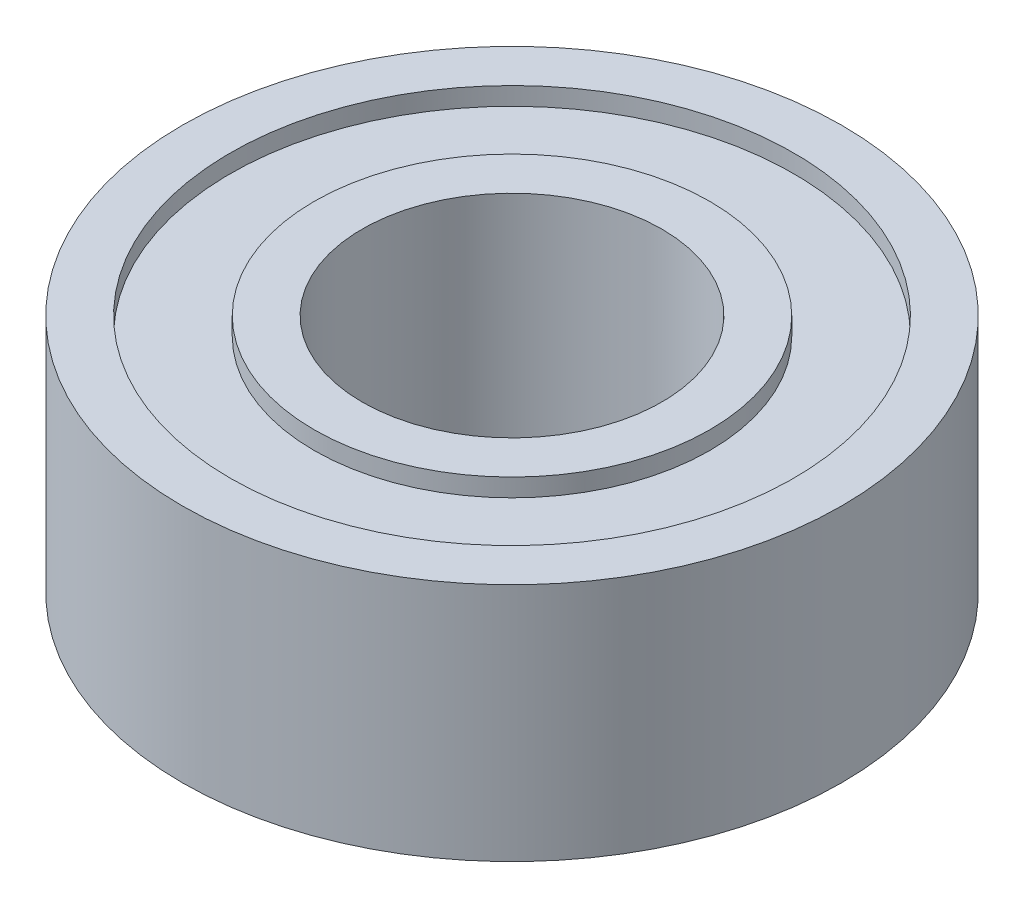
ISO-10303-21;
HEADER;
FILE_DESCRIPTION(('STEP AP214'),'2;1');
FILE_NAME('part.step','',(''),(''),'','','');
FILE_SCHEMA(('AUTOMOTIVE_DESIGN { 1 0 10303 214 1 1 1 1 }'));
ENDSEC;
DATA;
#1=APPLICATION_CONTEXT('core data for automotive mechanical design processes');
#2=APPLICATION_PROTOCOL_DEFINITION('international standard','automotive_design',2000,#1);
#3=PRODUCT_CONTEXT('',#1,'mechanical');
#4=PRODUCT('Part','Part','',(#3));
#5=PRODUCT_RELATED_PRODUCT_CATEGORY('part','',(#4));
#6=PRODUCT_DEFINITION_FORMATION('','',#4);
#7=PRODUCT_DEFINITION_CONTEXT('part definition',#1,'design');
#8=PRODUCT_DEFINITION('design','',#6,#7);
#9=PRODUCT_DEFINITION_SHAPE('','',#8);
#10=(LENGTH_UNIT() NAMED_UNIT(*) SI_UNIT(.MILLI.,.METRE.));
#11=(NAMED_UNIT(*) PLANE_ANGLE_UNIT() SI_UNIT($,.RADIAN.));
#12=(NAMED_UNIT(*) SI_UNIT($,.STERADIAN.) SOLID_ANGLE_UNIT());
#13=UNCERTAINTY_MEASURE_WITH_UNIT(LENGTH_MEASURE(1.E-05),#10,'distance_accuracy_value','');
#14=(GEOMETRIC_REPRESENTATION_CONTEXT(3) GLOBAL_UNCERTAINTY_ASSIGNED_CONTEXT((#13)) GLOBAL_UNIT_ASSIGNED_CONTEXT((#10,
#11,#12)) REPRESENTATION_CONTEXT('',''));
#15=CARTESIAN_POINT('',(0.,0.,0.));
#16=DIRECTION('',(0.,0.,1.));
#17=DIRECTION('',(1.,0.,0.));
#18=AXIS2_PLACEMENT_3D('',#15,#16,#17);
#19=CARTESIAN_POINT('',(2.5,2.,0.));
#20=DIRECTION('',(0.,-1.,0.));
#21=DIRECTION('',(0.,0.,-1.));
#22=AXIS2_PLACEMENT_3D('',#19,#20,#21);
#23=PLANE('',#22);
#24=CARTESIAN_POINT('',(0.,2.,0.));
#25=DIRECTION('',(0.,1.,0.));
#26=DIRECTION('',(0.,0.,1.));
#27=AXIS2_PLACEMENT_3D('',#24,#25,#26);
#28=CIRCLE('',#27,2.5);
#29=CARTESIAN_POINT('',(0.,2.,2.5));
#30=VERTEX_POINT('',#29);
#31=EDGE_CURVE('E78',#30,#30,#28,.T.);
#32=ORIENTED_EDGE('',*,*,#31,.F.);
#33=EDGE_LOOP('',(#32));
#34=FACE_BOUND('',#33,.T.);
#35=CARTESIAN_POINT('',(0.,2.,0.));
#36=DIRECTION('',(0.,1.,0.));
#37=DIRECTION('',(0.,0.,1.));
#38=AXIS2_PLACEMENT_3D('',#35,#36,#37);
#39=CIRCLE('',#38,3.3);
#40=CARTESIAN_POINT('',(0.,2.,3.3));
#41=VERTEX_POINT('',#40);
#42=EDGE_CURVE('E10',#41,#41,#39,.T.);
#43=ORIENTED_EDGE('',*,*,#42,.T.);
#44=EDGE_LOOP('',(#43));
#45=FACE_BOUND('',#44,.T.);
#46=ADVANCED_FACE('F38',(#34,#45),#23,.F.);
#47=CARTESIAN_POINT('',(0.,4.53448907506104,0.));
#48=DIRECTION('',(0.,1.,0.));
#49=DIRECTION('',(0.,0.,1.));
#50=AXIS2_PLACEMENT_3D('',#47,#48,#49);
#51=CYLINDRICAL_SURFACE('',#50,3.3);
#52=ORIENTED_EDGE('',*,*,#42,.F.);
#53=EDGE_LOOP('',(#52));
#54=FACE_BOUND('',#53,.T.);
#55=CARTESIAN_POINT('',(0.,1.7,0.));
#56=DIRECTION('',(0.,1.,0.));
#57=DIRECTION('',(0.,0.,1.));
#58=AXIS2_PLACEMENT_3D('',#55,#56,#57);
#59=CIRCLE('',#58,3.3);
#60=CARTESIAN_POINT('',(0.,1.7,3.3));
#61=VERTEX_POINT('',#60);
#62=EDGE_CURVE('E44',#61,#61,#59,.T.);
#63=ORIENTED_EDGE('',*,*,#62,.T.);
#64=EDGE_LOOP('',(#63));
#65=FACE_BOUND('',#64,.T.);
#66=ADVANCED_FACE('F85',(#54,#65),#51,.T.);
#67=CARTESIAN_POINT('',(3.3,1.7,0.));
#68=DIRECTION('',(0.,-1.,0.));
#69=DIRECTION('',(0.,0.,-1.));
#70=AXIS2_PLACEMENT_3D('',#67,#68,#69);
#71=PLANE('',#70);
#72=ORIENTED_EDGE('',*,*,#62,.F.);
#73=EDGE_LOOP('',(#72));
#74=FACE_BOUND('',#73,.T.);
#75=CARTESIAN_POINT('',(0.,1.7,0.));
#76=DIRECTION('',(0.,1.,0.));
#77=DIRECTION('',(0.,0.,1.));
#78=AXIS2_PLACEMENT_3D('',#75,#76,#77);
#79=CIRCLE('',#78,4.69999999999999);
#80=CARTESIAN_POINT('',(0.,1.7,4.69999999999999));
#81=VERTEX_POINT('',#80);
#82=EDGE_CURVE('E48',#81,#81,#79,.T.);
#83=ORIENTED_EDGE('',*,*,#82,.T.);
#84=EDGE_LOOP('',(#83));
#85=FACE_BOUND('',#84,.T.);
#86=ADVANCED_FACE('F89',(#74,#85),#71,.F.);
#87=CARTESIAN_POINT('',(0.,4.53448907506104,0.));
#88=DIRECTION('',(0.,1.,0.));
#89=DIRECTION('',(0.,0.,1.));
#90=AXIS2_PLACEMENT_3D('',#87,#88,#89);
#91=CYLINDRICAL_SURFACE('',#90,4.69999999999999);
#92=ORIENTED_EDGE('',*,*,#82,.F.);
#93=EDGE_LOOP('',(#92));
#94=FACE_BOUND('',#93,.T.);
#95=CARTESIAN_POINT('',(0.,2.,0.));
#96=DIRECTION('',(0.,1.,0.));
#97=DIRECTION('',(0.,0.,1.));
#98=AXIS2_PLACEMENT_3D('',#95,#96,#97);
#99=CIRCLE('',#98,4.69999999999999);
#100=CARTESIAN_POINT('',(0.,2.,4.69999999999999));
#101=VERTEX_POINT('',#100);
#102=EDGE_CURVE('E52',#101,#101,#99,.T.);
#103=ORIENTED_EDGE('',*,*,#102,.T.);
#104=EDGE_LOOP('',(#103));
#105=FACE_BOUND('',#104,.T.);
#106=ADVANCED_FACE('F94',(#94,#105),#91,.F.);
#107=CARTESIAN_POINT('',(4.69999999999999,2.,0.));
#108=DIRECTION('',(0.,-1.,0.));
#109=DIRECTION('',(0.,0.,-1.));
#110=AXIS2_PLACEMENT_3D('',#107,#108,#109);
#111=PLANE('',#110);
#112=ORIENTED_EDGE('',*,*,#102,.F.);
#113=EDGE_LOOP('',(#112));
#114=FACE_BOUND('',#113,.T.);
#115=CARTESIAN_POINT('',(0.,2.,0.));
#116=DIRECTION('',(0.,1.,0.));
#117=DIRECTION('',(0.,0.,1.));
#118=AXIS2_PLACEMENT_3D('',#115,#116,#117);
#119=CIRCLE('',#118,5.5);
#120=CARTESIAN_POINT('',(0.,2.,5.5));
#121=VERTEX_POINT('',#120);
#122=EDGE_CURVE('E57',#121,#121,#119,.T.);
#123=ORIENTED_EDGE('',*,*,#122,.T.);
#124=EDGE_LOOP('',(#123));
#125=FACE_BOUND('',#124,.T.);
#126=ADVANCED_FACE('F100',(#114,#125),#111,.F.);
#127=CARTESIAN_POINT('',(0.,4.53448907506104,0.));
#128=DIRECTION('',(0.,1.,0.));
#129=DIRECTION('',(0.,0.,1.));
#130=AXIS2_PLACEMENT_3D('',#127,#128,#129);
#131=CYLINDRICAL_SURFACE('',#130,5.5);
#132=ORIENTED_EDGE('',*,*,#122,.F.);
#133=EDGE_LOOP('',(#132));
#134=FACE_BOUND('',#133,.T.);
#135=CARTESIAN_POINT('',(0.,-2.,0.));
#136=DIRECTION('',(0.,1.,0.));
#137=DIRECTION('',(0.,0.,1.));
#138=AXIS2_PLACEMENT_3D('',#135,#136,#137);
#139=CIRCLE('',#138,5.5);
#140=CARTESIAN_POINT('',(0.,-2.,5.5));
#141=VERTEX_POINT('',#140);
#142=EDGE_CURVE('E60',#141,#141,#139,.T.);
#143=ORIENTED_EDGE('',*,*,#142,.T.);
#144=EDGE_LOOP('',(#143));
#145=FACE_BOUND('',#144,.T.);
#146=ADVANCED_FACE('F104',(#134,#145),#131,.T.);
#147=CARTESIAN_POINT('',(4.69999999999999,-2.,0.));
#148=DIRECTION('',(0.,1.,0.));
#149=DIRECTION('',(0.,0.,1.));
#150=AXIS2_PLACEMENT_3D('',#147,#148,#149);
#151=PLANE('',#150);
#152=ORIENTED_EDGE('',*,*,#142,.F.);
#153=EDGE_LOOP('',(#152));
#154=FACE_BOUND('',#153,.T.);
#155=CARTESIAN_POINT('',(0.,-2.,0.));
#156=DIRECTION('',(0.,1.,0.));
#157=DIRECTION('',(0.,0.,1.));
#158=AXIS2_PLACEMENT_3D('',#155,#156,#157);
#159=CIRCLE('',#158,4.69999999999999);
#160=CARTESIAN_POINT('',(0.,-2.,4.69999999999999));
#161=VERTEX_POINT('',#160);
#162=EDGE_CURVE('E63',#161,#161,#159,.T.);
#163=ORIENTED_EDGE('',*,*,#162,.T.);
#164=EDGE_LOOP('',(#163));
#165=FACE_BOUND('',#164,.T.);
#166=ADVANCED_FACE('F108',(#154,#165),#151,.F.);
#167=CARTESIAN_POINT('',(0.,4.53448907506104,0.));
#168=DIRECTION('',(0.,1.,0.));
#169=DIRECTION('',(0.,0.,1.));
#170=AXIS2_PLACEMENT_3D('',#167,#168,#169);
#171=CYLINDRICAL_SURFACE('',#170,4.69999999999999);
#172=ORIENTED_EDGE('',*,*,#162,.F.);
#173=EDGE_LOOP('',(#172));
#174=FACE_BOUND('',#173,.T.);
#175=CARTESIAN_POINT('',(0.,-1.7,0.));
#176=DIRECTION('',(0.,1.,0.));
#177=DIRECTION('',(0.,0.,1.));
#178=AXIS2_PLACEMENT_3D('',#175,#176,#177);
#179=CIRCLE('',#178,4.69999999999999);
#180=CARTESIAN_POINT('',(0.,-1.7,4.69999999999999));
#181=VERTEX_POINT('',#180);
#182=EDGE_CURVE('E66',#181,#181,#179,.T.);
#183=ORIENTED_EDGE('',*,*,#182,.T.);
#184=EDGE_LOOP('',(#183));
#185=FACE_BOUND('',#184,.T.);
#186=ADVANCED_FACE('F112',(#174,#185),#171,.F.);
#187=CARTESIAN_POINT('',(3.3,-1.7,0.));
#188=DIRECTION('',(0.,1.,0.));
#189=DIRECTION('',(0.,0.,1.));
#190=AXIS2_PLACEMENT_3D('',#187,#188,#189);
#191=PLANE('',#190);
#192=ORIENTED_EDGE('',*,*,#182,.F.);
#193=EDGE_LOOP('',(#192));
#194=FACE_BOUND('',#193,.T.);
#195=CARTESIAN_POINT('',(0.,-1.7,0.));
#196=DIRECTION('',(0.,1.,0.));
#197=DIRECTION('',(0.,0.,1.));
#198=AXIS2_PLACEMENT_3D('',#195,#196,#197);
#199=CIRCLE('',#198,3.3);
#200=CARTESIAN_POINT('',(0.,-1.7,3.3));
#201=VERTEX_POINT('',#200);
#202=EDGE_CURVE('E69',#201,#201,#199,.T.);
#203=ORIENTED_EDGE('',*,*,#202,.T.);
#204=EDGE_LOOP('',(#203));
#205=FACE_BOUND('',#204,.T.);
#206=ADVANCED_FACE('F116',(#194,#205),#191,.F.);
#207=CARTESIAN_POINT('',(0.,4.53448907506104,0.));
#208=DIRECTION('',(0.,1.,0.));
#209=DIRECTION('',(0.,0.,1.));
#210=AXIS2_PLACEMENT_3D('',#207,#208,#209);
#211=CYLINDRICAL_SURFACE('',#210,3.3);
#212=ORIENTED_EDGE('',*,*,#202,.F.);
#213=EDGE_LOOP('',(#212));
#214=FACE_BOUND('',#213,.T.);
#215=CARTESIAN_POINT('',(0.,-2.,0.));
#216=DIRECTION('',(0.,1.,0.));
#217=DIRECTION('',(0.,0.,1.));
#218=AXIS2_PLACEMENT_3D('',#215,#216,#217);
#219=CIRCLE('',#218,3.3);
#220=CARTESIAN_POINT('',(0.,-2.,3.3));
#221=VERTEX_POINT('',#220);
#222=EDGE_CURVE('E72',#221,#221,#219,.T.);
#223=ORIENTED_EDGE('',*,*,#222,.T.);
#224=EDGE_LOOP('',(#223));
#225=FACE_BOUND('',#224,.T.);
#226=ADVANCED_FACE('F120',(#214,#225),#211,.T.);
#227=CARTESIAN_POINT('',(2.5,-2.,0.));
#228=DIRECTION('',(0.,1.,0.));
#229=DIRECTION('',(0.,0.,1.));
#230=AXIS2_PLACEMENT_3D('',#227,#228,#229);
#231=PLANE('',#230);
#232=ORIENTED_EDGE('',*,*,#222,.F.);
#233=EDGE_LOOP('',(#232));
#234=FACE_BOUND('',#233,.T.);
#235=CARTESIAN_POINT('',(0.,-2.,0.));
#236=DIRECTION('',(0.,1.,0.));
#237=DIRECTION('',(0.,0.,1.));
#238=AXIS2_PLACEMENT_3D('',#235,#236,#237);
#239=CIRCLE('',#238,2.5);
#240=CARTESIAN_POINT('',(0.,-2.,2.5));
#241=VERTEX_POINT('',#240);
#242=EDGE_CURVE('E75',#241,#241,#239,.T.);
#243=ORIENTED_EDGE('',*,*,#242,.T.);
#244=EDGE_LOOP('',(#243));
#245=FACE_BOUND('',#244,.T.);
#246=ADVANCED_FACE('F124',(#234,#245),#231,.F.);
#247=CARTESIAN_POINT('',(0.,4.53448907506104,0.));
#248=DIRECTION('',(0.,1.,0.));
#249=DIRECTION('',(0.,0.,1.));
#250=AXIS2_PLACEMENT_3D('',#247,#248,#249);
#251=CYLINDRICAL_SURFACE('',#250,2.5);
#252=ORIENTED_EDGE('',*,*,#242,.F.);
#253=EDGE_LOOP('',(#252));
#254=FACE_BOUND('',#253,.T.);
#255=ORIENTED_EDGE('',*,*,#31,.T.);
#256=EDGE_LOOP('',(#255));
#257=FACE_BOUND('',#256,.T.);
#258=ADVANCED_FACE('F82',(#254,#257),#251,.F.);
#259=CLOSED_SHELL('',(#46,#66,#86,#106,#126,#146,#166,#186,#206,#226,#246,#258));
#260=MANIFOLD_SOLID_BREP('B2',#259);
#261=ADVANCED_BREP_SHAPE_REPRESENTATION('',(#18,#260),#14);
#262=SHAPE_DEFINITION_REPRESENTATION(#9,#261);
ENDSEC;
END-ISO-10303-21;
